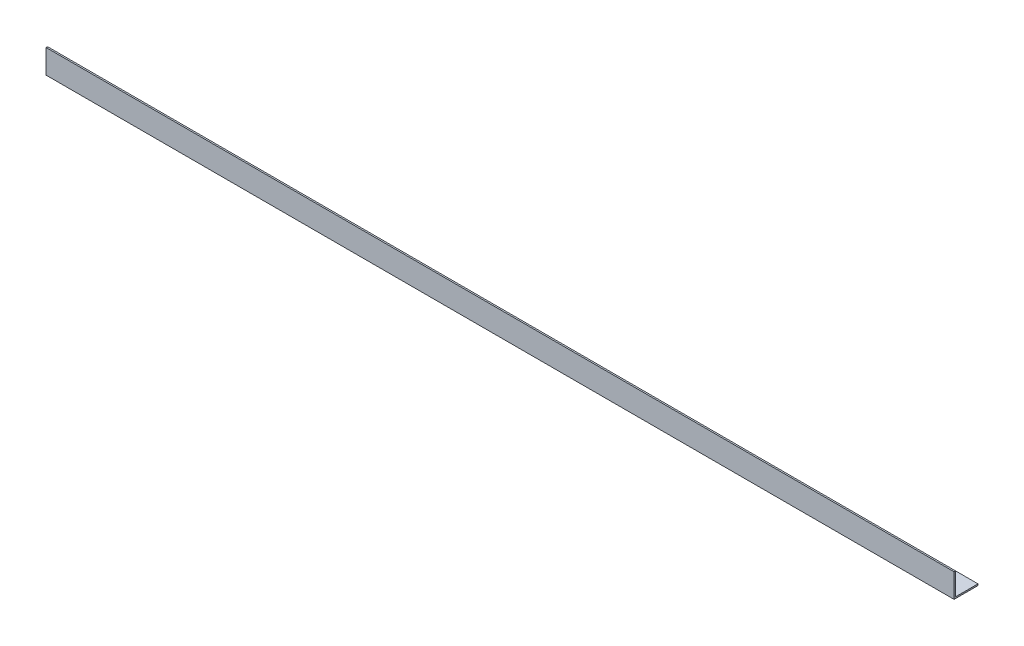
ISO-10303-21;
HEADER;
FILE_DESCRIPTION(('STEP AP214'),'2;1');
FILE_NAME('part.step','',(''),(''),'','','');
FILE_SCHEMA(('AUTOMOTIVE_DESIGN { 1 0 10303 214 1 1 1 1 }'));
ENDSEC;
DATA;
#1=APPLICATION_CONTEXT('core data for automotive mechanical design processes');
#2=APPLICATION_PROTOCOL_DEFINITION('international standard','automotive_design',2000,#1);
#3=PRODUCT_CONTEXT('',#1,'mechanical');
#4=PRODUCT('Part','Part','',(#3));
#5=PRODUCT_RELATED_PRODUCT_CATEGORY('part','',(#4));
#6=PRODUCT_DEFINITION_FORMATION('','',#4);
#7=PRODUCT_DEFINITION_CONTEXT('part definition',#1,'design');
#8=PRODUCT_DEFINITION('design','',#6,#7);
#9=PRODUCT_DEFINITION_SHAPE('','',#8);
#10=(LENGTH_UNIT() NAMED_UNIT(*) SI_UNIT(.MILLI.,.METRE.));
#11=(NAMED_UNIT(*) PLANE_ANGLE_UNIT() SI_UNIT($,.RADIAN.));
#12=(NAMED_UNIT(*) SI_UNIT($,.STERADIAN.) SOLID_ANGLE_UNIT());
#13=UNCERTAINTY_MEASURE_WITH_UNIT(LENGTH_MEASURE(1.E-05),#10,'distance_accuracy_value','');
#14=(GEOMETRIC_REPRESENTATION_CONTEXT(3) GLOBAL_UNCERTAINTY_ASSIGNED_CONTEXT((#13)) GLOBAL_UNIT_ASSIGNED_CONTEXT((#10,
#11,#12)) REPRESENTATION_CONTEXT('',''));
#15=CARTESIAN_POINT('',(0.,0.,0.));
#16=DIRECTION('',(0.,0.,1.));
#17=DIRECTION('',(1.,0.,0.));
#18=AXIS2_PLACEMENT_3D('',#15,#16,#17);
#19=CARTESIAN_POINT('',(607.,16.,-0.999999999999999));
#20=DIRECTION('',(0.,-1.,0.));
#21=DIRECTION('',(0.,0.,-1.));
#22=AXIS2_PLACEMENT_3D('',#19,#20,#21);
#23=PLANE('',#22);
#24=DIRECTION('',(0.,0.,1.));
#25=VECTOR('',#24,1.);
#26=CARTESIAN_POINT('',(0.,16.,-0.999999999999999));
#27=LINE('',#26,#25);
#28=CARTESIAN_POINT('',(0.,16.,-0.999999999999999));
#29=VERTEX_POINT('',#28);
#30=CARTESIAN_POINT('',(0.,16.,0.));
#31=VERTEX_POINT('',#30);
#32=EDGE_CURVE('E116',#29,#31,#27,.T.);
#33=ORIENTED_EDGE('',*,*,#32,.T.);
#34=DIRECTION('',(-1.,0.,0.));
#35=VECTOR('',#34,1.);
#36=CARTESIAN_POINT('',(607.,16.,0.));
#37=LINE('',#36,#35);
#38=CARTESIAN_POINT('',(607.,16.,0.));
#39=VERTEX_POINT('',#38);
#40=EDGE_CURVE('E11',#39,#31,#37,.T.);
#41=ORIENTED_EDGE('',*,*,#40,.F.);
#42=DIRECTION('',(0.,0.,1.));
#43=VECTOR('',#42,1.);
#44=CARTESIAN_POINT('',(607.,16.,-0.999999999999999));
#45=LINE('',#44,#43);
#46=CARTESIAN_POINT('',(607.,16.,-0.999999999999999));
#47=VERTEX_POINT('',#46);
#48=EDGE_CURVE('E126',#47,#39,#45,.T.);
#49=ORIENTED_EDGE('',*,*,#48,.F.);
#50=DIRECTION('',(-1.,0.,0.));
#51=VECTOR('',#50,1.);
#52=CARTESIAN_POINT('',(607.,16.,-0.999999999999999));
#53=LINE('',#52,#51);
#54=EDGE_CURVE('E112',#47,#29,#53,.T.);
#55=ORIENTED_EDGE('',*,*,#54,.T.);
#56=EDGE_LOOP('',(#33,#41,#49,#55));
#57=FACE_BOUND('',#56,.T.);
#58=ADVANCED_FACE('F32',(#57),#23,.F.);
#59=CARTESIAN_POINT('',(607.,16.,0.));
#60=DIRECTION('',(0.,0.,-1.));
#61=DIRECTION('',(0.,1.,0.));
#62=AXIS2_PLACEMENT_3D('',#59,#60,#61);
#63=PLANE('',#62);
#64=DIRECTION('',(0.,-1.,0.));
#65=VECTOR('',#64,1.);
#66=CARTESIAN_POINT('',(0.,16.,0.));
#67=LINE('',#66,#65);
#68=CARTESIAN_POINT('',(0.,0.,0.));
#69=VERTEX_POINT('',#68);
#70=EDGE_CURVE('E119',#31,#69,#67,.T.);
#71=ORIENTED_EDGE('',*,*,#70,.T.);
#72=DIRECTION('',(-1.,0.,0.));
#73=VECTOR('',#72,1.);
#74=CARTESIAN_POINT('',(607.,0.,0.));
#75=LINE('',#74,#73);
#76=CARTESIAN_POINT('',(607.,0.,0.));
#77=VERTEX_POINT('',#76);
#78=EDGE_CURVE('E40',#77,#69,#75,.T.);
#79=ORIENTED_EDGE('',*,*,#78,.F.);
#80=DIRECTION('',(0.,-1.,0.));
#81=VECTOR('',#80,1.);
#82=CARTESIAN_POINT('',(607.,16.,0.));
#83=LINE('',#82,#81);
#84=EDGE_CURVE('E85',#39,#77,#83,.T.);
#85=ORIENTED_EDGE('',*,*,#84,.F.);
#86=ORIENTED_EDGE('',*,*,#40,.T.);
#87=EDGE_LOOP('',(#71,#79,#85,#86));
#88=FACE_BOUND('',#87,.T.);
#89=ADVANCED_FACE('F150',(#88),#63,.F.);
#90=CARTESIAN_POINT('',(607.,0.,0.));
#91=DIRECTION('',(0.,1.,0.));
#92=DIRECTION('',(0.,0.,1.));
#93=AXIS2_PLACEMENT_3D('',#90,#91,#92);
#94=PLANE('',#93);
#95=DIRECTION('',(0.,0.,-1.));
#96=VECTOR('',#95,1.);
#97=CARTESIAN_POINT('',(0.,0.,0.));
#98=LINE('',#97,#96);
#99=CARTESIAN_POINT('',(0.,0.,-16.));
#100=VERTEX_POINT('',#99);
#101=EDGE_CURVE('E121',#69,#100,#98,.T.);
#102=ORIENTED_EDGE('',*,*,#101,.T.);
#103=DIRECTION('',(-1.,0.,0.));
#104=VECTOR('',#103,1.);
#105=CARTESIAN_POINT('',(607.,0.,-16.));
#106=LINE('',#105,#104);
#107=CARTESIAN_POINT('',(607.,0.,-16.));
#108=VERTEX_POINT('',#107);
#109=EDGE_CURVE('E107',#108,#100,#106,.T.);
#110=ORIENTED_EDGE('',*,*,#109,.F.);
#111=DIRECTION('',(0.,0.,-1.));
#112=VECTOR('',#111,1.);
#113=CARTESIAN_POINT('',(607.,0.,0.));
#114=LINE('',#113,#112);
#115=EDGE_CURVE('E98',#77,#108,#114,.T.);
#116=ORIENTED_EDGE('',*,*,#115,.F.);
#117=ORIENTED_EDGE('',*,*,#78,.T.);
#118=EDGE_LOOP('',(#102,#110,#116,#117));
#119=FACE_BOUND('',#118,.T.);
#120=ADVANCED_FACE('F132',(#119),#94,.F.);
#121=CARTESIAN_POINT('',(607.,0.,-16.));
#122=DIRECTION('',(0.,0.,1.));
#123=DIRECTION('',(1.,0.,0.));
#124=AXIS2_PLACEMENT_3D('',#121,#122,#123);
#125=PLANE('',#124);
#126=DIRECTION('',(0.,1.,0.));
#127=VECTOR('',#126,1.);
#128=CARTESIAN_POINT('',(0.,0.,-16.));
#129=LINE('',#128,#127);
#130=CARTESIAN_POINT('',(0.,1.,-16.));
#131=VERTEX_POINT('',#130);
#132=EDGE_CURVE('E106',#100,#131,#129,.T.);
#133=ORIENTED_EDGE('',*,*,#132,.T.);
#134=DIRECTION('',(-1.,0.,0.));
#135=VECTOR('',#134,1.);
#136=CARTESIAN_POINT('',(607.,1.,-16.));
#137=LINE('',#136,#135);
#138=CARTESIAN_POINT('',(607.,1.,-16.));
#139=VERTEX_POINT('',#138);
#140=EDGE_CURVE('E103',#139,#131,#137,.T.);
#141=ORIENTED_EDGE('',*,*,#140,.F.);
#142=DIRECTION('',(0.,1.,0.));
#143=VECTOR('',#142,1.);
#144=CARTESIAN_POINT('',(607.,0.,-16.));
#145=LINE('',#144,#143);
#146=EDGE_CURVE('E92',#108,#139,#145,.T.);
#147=ORIENTED_EDGE('',*,*,#146,.F.);
#148=ORIENTED_EDGE('',*,*,#109,.T.);
#149=EDGE_LOOP('',(#133,#141,#147,#148));
#150=FACE_BOUND('',#149,.T.);
#151=ADVANCED_FACE('F104',(#150),#125,.F.);
#152=CARTESIAN_POINT('',(607.,1.,-16.));
#153=DIRECTION('',(0.,-1.,0.));
#154=DIRECTION('',(0.,0.,-1.));
#155=AXIS2_PLACEMENT_3D('',#152,#153,#154);
#156=PLANE('',#155);
#157=DIRECTION('',(0.,0.,1.));
#158=VECTOR('',#157,1.);
#159=CARTESIAN_POINT('',(0.,1.,-16.));
#160=LINE('',#159,#158);
#161=CARTESIAN_POINT('',(0.,0.999999999999998,-1.));
#162=VERTEX_POINT('',#161);
#163=EDGE_CURVE('E71',#131,#162,#160,.T.);
#164=ORIENTED_EDGE('',*,*,#163,.T.);
#165=DIRECTION('',(-1.,0.,0.));
#166=VECTOR('',#165,1.);
#167=CARTESIAN_POINT('',(607.,0.999999999999998,-1.));
#168=LINE('',#167,#166);
#169=CARTESIAN_POINT('',(607.,0.999999999999998,-1.));
#170=VERTEX_POINT('',#169);
#171=EDGE_CURVE('E108',#170,#162,#168,.T.);
#172=ORIENTED_EDGE('',*,*,#171,.F.);
#173=DIRECTION('',(0.,0.,1.));
#174=VECTOR('',#173,1.);
#175=CARTESIAN_POINT('',(607.,1.,-16.));
#176=LINE('',#175,#174);
#177=EDGE_CURVE('E96',#139,#170,#176,.T.);
#178=ORIENTED_EDGE('',*,*,#177,.F.);
#179=ORIENTED_EDGE('',*,*,#140,.T.);
#180=EDGE_LOOP('',(#164,#172,#178,#179));
#181=FACE_BOUND('',#180,.T.);
#182=ADVANCED_FACE('F110',(#181),#156,.F.);
#183=CARTESIAN_POINT('',(607.,0.999999999999998,-1.));
#184=DIRECTION('',(0.,0.,1.));
#185=DIRECTION('',(0.,-1.,0.));
#186=AXIS2_PLACEMENT_3D('',#183,#184,#185);
#187=PLANE('',#186);
#188=DIRECTION('',(0.,1.,0.));
#189=VECTOR('',#188,1.);
#190=CARTESIAN_POINT('',(0.,0.999999999999998,-1.));
#191=LINE('',#190,#189);
#192=EDGE_CURVE('E77',#162,#29,#191,.T.);
#193=ORIENTED_EDGE('',*,*,#192,.T.);
#194=ORIENTED_EDGE('',*,*,#54,.F.);
#195=DIRECTION('',(0.,1.,0.));
#196=VECTOR('',#195,1.);
#197=CARTESIAN_POINT('',(607.,0.999999999999998,-1.));
#198=LINE('',#197,#196);
#199=EDGE_CURVE('E48',#170,#47,#198,.T.);
#200=ORIENTED_EDGE('',*,*,#199,.F.);
#201=ORIENTED_EDGE('',*,*,#171,.T.);
#202=EDGE_LOOP('',(#193,#194,#200,#201));
#203=FACE_BOUND('',#202,.T.);
#204=ADVANCED_FACE('F139',(#203),#187,.F.);
#205=CARTESIAN_POINT('',(607.,0.,0.));
#206=DIRECTION('',(1.,0.,0.));
#207=DIRECTION('',(0.,0.,-1.));
#208=AXIS2_PLACEMENT_3D('',#205,#206,#207);
#209=PLANE('',#208);
#210=ORIENTED_EDGE('',*,*,#48,.T.);
#211=ORIENTED_EDGE('',*,*,#84,.T.);
#212=ORIENTED_EDGE('',*,*,#115,.T.);
#213=ORIENTED_EDGE('',*,*,#146,.T.);
#214=ORIENTED_EDGE('',*,*,#177,.T.);
#215=ORIENTED_EDGE('',*,*,#199,.T.);
#216=EDGE_LOOP('',(#210,#211,#212,#213,#214,#215));
#217=FACE_BOUND('',#216,.T.);
#218=ADVANCED_FACE('F94',(#217),#209,.T.);
#219=CARTESIAN_POINT('',(0.,0.,0.));
#220=DIRECTION('',(1.,0.,0.));
#221=DIRECTION('',(0.,0.,-1.));
#222=AXIS2_PLACEMENT_3D('',#219,#220,#221);
#223=PLANE('',#222);
#224=ORIENTED_EDGE('',*,*,#32,.F.);
#225=ORIENTED_EDGE('',*,*,#192,.F.);
#226=ORIENTED_EDGE('',*,*,#163,.F.);
#227=ORIENTED_EDGE('',*,*,#132,.F.);
#228=ORIENTED_EDGE('',*,*,#101,.F.);
#229=ORIENTED_EDGE('',*,*,#70,.F.);
#230=EDGE_LOOP('',(#224,#225,#226,#227,#228,#229));
#231=FACE_BOUND('',#230,.T.);
#232=ADVANCED_FACE('F135',(#231),#223,.F.);
#233=CLOSED_SHELL('',(#58,#89,#120,#151,#182,#204,#218,#232));
#234=MANIFOLD_SOLID_BREP('B2',#233);
#235=ADVANCED_BREP_SHAPE_REPRESENTATION('',(#18,#234),#14);
#236=SHAPE_DEFINITION_REPRESENTATION(#9,#235);
ENDSEC;
END-ISO-10303-21;
